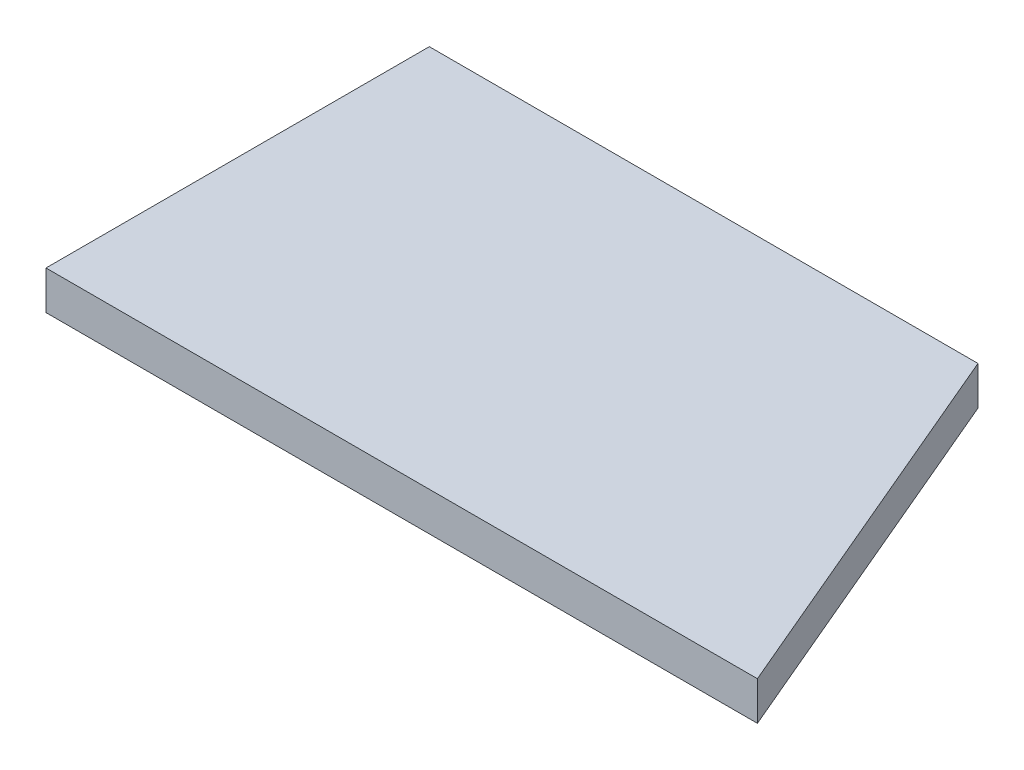
ISO-10303-21;
HEADER;
FILE_DESCRIPTION(('STEP AP214'),'2;1');
FILE_NAME('part.step','',(''),(''),'','','');
FILE_SCHEMA(('AUTOMOTIVE_DESIGN { 1 0 10303 214 1 1 1 1 }'));
ENDSEC;
DATA;
#1=APPLICATION_CONTEXT('core data for automotive mechanical design processes');
#2=APPLICATION_PROTOCOL_DEFINITION('international standard','automotive_design',2000,#1);
#3=PRODUCT_CONTEXT('',#1,'mechanical');
#4=PRODUCT('Part','Part','',(#3));
#5=PRODUCT_RELATED_PRODUCT_CATEGORY('part','',(#4));
#6=PRODUCT_DEFINITION_FORMATION('','',#4);
#7=PRODUCT_DEFINITION_CONTEXT('part definition',#1,'design');
#8=PRODUCT_DEFINITION('design','',#6,#7);
#9=PRODUCT_DEFINITION_SHAPE('','',#8);
#10=(LENGTH_UNIT() NAMED_UNIT(*) SI_UNIT(.MILLI.,.METRE.));
#11=(NAMED_UNIT(*) PLANE_ANGLE_UNIT() SI_UNIT($,.RADIAN.));
#12=(NAMED_UNIT(*) SI_UNIT($,.STERADIAN.) SOLID_ANGLE_UNIT());
#13=UNCERTAINTY_MEASURE_WITH_UNIT(LENGTH_MEASURE(1.E-05),#10,'distance_accuracy_value','');
#14=(GEOMETRIC_REPRESENTATION_CONTEXT(3) GLOBAL_UNCERTAINTY_ASSIGNED_CONTEXT((#13)) GLOBAL_UNIT_ASSIGNED_CONTEXT((#10,
#11,#12)) REPRESENTATION_CONTEXT('',''));
#15=CARTESIAN_POINT('',(0.,0.,0.));
#16=DIRECTION('',(0.,0.,1.));
#17=DIRECTION('',(1.,0.,0.));
#18=AXIS2_PLACEMENT_3D('',#15,#16,#17);
#19=CARTESIAN_POINT('',(0.,5.,-49.5707034160857));
#20=DIRECTION('',(1.,0.,0.));
#21=DIRECTION('',(0.,0.,-1.));
#22=AXIS2_PLACEMENT_3D('',#19,#20,#21);
#23=PLANE('',#22);
#24=DIRECTION('',(0.,0.,1.));
#25=VECTOR('',#24,1.);
#26=CARTESIAN_POINT('',(0.,0.,-49.5707034160857));
#27=LINE('',#26,#25);
#28=CARTESIAN_POINT('',(0.,0.,-49.5707034160857));
#29=VERTEX_POINT('',#28);
#30=CARTESIAN_POINT('',(0.,0.,0.));
#31=VERTEX_POINT('',#30);
#32=EDGE_CURVE('E97',#29,#31,#27,.T.);
#33=ORIENTED_EDGE('',*,*,#32,.T.);
#34=DIRECTION('',(0.,-1.,0.));
#35=VECTOR('',#34,1.);
#36=CARTESIAN_POINT('',(0.,5.,0.));
#37=LINE('',#36,#35);
#38=CARTESIAN_POINT('',(0.,5.,0.));
#39=VERTEX_POINT('',#38);
#40=EDGE_CURVE('E11',#39,#31,#37,.T.);
#41=ORIENTED_EDGE('',*,*,#40,.F.);
#42=DIRECTION('',(0.,0.,1.));
#43=VECTOR('',#42,1.);
#44=CARTESIAN_POINT('',(0.,5.,-49.5707034160857));
#45=LINE('',#44,#43);
#46=CARTESIAN_POINT('',(0.,5.,-49.5707034160857));
#47=VERTEX_POINT('',#46);
#48=EDGE_CURVE('E85',#47,#39,#45,.T.);
#49=ORIENTED_EDGE('',*,*,#48,.F.);
#50=DIRECTION('',(0.,-1.,0.));
#51=VECTOR('',#50,1.);
#52=CARTESIAN_POINT('',(0.,5.,-49.5707034160857));
#53=LINE('',#52,#51);
#54=EDGE_CURVE('E93',#47,#29,#53,.T.);
#55=ORIENTED_EDGE('',*,*,#54,.T.);
#56=EDGE_LOOP('',(#33,#41,#49,#55));
#57=FACE_BOUND('',#56,.T.);
#58=ADVANCED_FACE('F34',(#57),#23,.F.);
#59=CARTESIAN_POINT('',(0.,5.,0.));
#60=DIRECTION('',(0.,0.,-1.));
#61=DIRECTION('',(-1.,0.,0.));
#62=AXIS2_PLACEMENT_3D('',#59,#60,#61);
#63=PLANE('',#62);
#64=DIRECTION('',(1.,0.,0.));
#65=VECTOR('',#64,1.);
#66=CARTESIAN_POINT('',(0.,0.,0.));
#67=LINE('',#66,#65);
#68=CARTESIAN_POINT('',(92.,0.,0.));
#69=VERTEX_POINT('',#68);
#70=EDGE_CURVE('E89',#31,#69,#67,.T.);
#71=ORIENTED_EDGE('',*,*,#70,.T.);
#72=DIRECTION('',(0.,-1.,0.));
#73=VECTOR('',#72,1.);
#74=CARTESIAN_POINT('',(92.,5.,0.));
#75=LINE('',#74,#73);
#76=CARTESIAN_POINT('',(92.,5.,0.));
#77=VERTEX_POINT('',#76);
#78=EDGE_CURVE('E42',#77,#69,#75,.T.);
#79=ORIENTED_EDGE('',*,*,#78,.F.);
#80=DIRECTION('',(1.,0.,0.));
#81=VECTOR('',#80,1.);
#82=CARTESIAN_POINT('',(0.,5.,0.));
#83=LINE('',#82,#81);
#84=EDGE_CURVE('E80',#39,#77,#83,.T.);
#85=ORIENTED_EDGE('',*,*,#84,.F.);
#86=ORIENTED_EDGE('',*,*,#40,.T.);
#87=EDGE_LOOP('',(#71,#79,#85,#86));
#88=FACE_BOUND('',#87,.T.);
#89=ADVANCED_FACE('F88',(#88),#63,.F.);
#90=CARTESIAN_POINT('',(92.,5.,0.));
#91=DIRECTION('',(-0.920504853452437,0.,0.390731128489282));
#92=DIRECTION('',(0.390731128489282,0.,0.920504853452437));
#93=AXIS2_PLACEMENT_3D('',#90,#91,#92);
#94=PLANE('',#93);
#95=DIRECTION('',(-0.390731128489282,0.,-0.920504853452437));
#96=VECTOR('',#95,1.);
#97=CARTESIAN_POINT('',(92.,0.,0.));
#98=LINE('',#97,#96);
#99=CARTESIAN_POINT('',(70.9584847780756,0.,-49.5707034160857));
#100=VERTEX_POINT('',#99);
#101=EDGE_CURVE('E67',#69,#100,#98,.T.);
#102=ORIENTED_EDGE('',*,*,#101,.T.);
#103=DIRECTION('',(0.,-1.,0.));
#104=VECTOR('',#103,1.);
#105=CARTESIAN_POINT('',(70.9584847780756,5.,-49.5707034160857));
#106=LINE('',#105,#104);
#107=CARTESIAN_POINT('',(70.9584847780756,5.,-49.5707034160857));
#108=VERTEX_POINT('',#107);
#109=EDGE_CURVE('E90',#108,#100,#106,.T.);
#110=ORIENTED_EDGE('',*,*,#109,.F.);
#111=DIRECTION('',(-0.390731128489282,0.,-0.920504853452437));
#112=VECTOR('',#111,1.);
#113=CARTESIAN_POINT('',(92.,5.,0.));
#114=LINE('',#113,#112);
#115=EDGE_CURVE('E83',#77,#108,#114,.T.);
#116=ORIENTED_EDGE('',*,*,#115,.F.);
#117=ORIENTED_EDGE('',*,*,#78,.T.);
#118=EDGE_LOOP('',(#102,#110,#116,#117));
#119=FACE_BOUND('',#118,.T.);
#120=ADVANCED_FACE('F91',(#119),#94,.F.);
#121=CARTESIAN_POINT('',(70.9584847780756,5.,-49.5707034160857));
#122=DIRECTION('',(0.,0.,1.));
#123=DIRECTION('',(1.,0.,0.));
#124=AXIS2_PLACEMENT_3D('',#121,#122,#123);
#125=PLANE('',#124);
#126=DIRECTION('',(-1.,0.,0.));
#127=VECTOR('',#126,1.);
#128=CARTESIAN_POINT('',(70.9584847780756,0.,-49.5707034160857));
#129=LINE('',#128,#127);
#130=EDGE_CURVE('E73',#100,#29,#129,.T.);
#131=ORIENTED_EDGE('',*,*,#130,.T.);
#132=ORIENTED_EDGE('',*,*,#54,.F.);
#133=DIRECTION('',(-1.,0.,0.));
#134=VECTOR('',#133,1.);
#135=CARTESIAN_POINT('',(70.9584847780756,5.,-49.5707034160857));
#136=LINE('',#135,#134);
#137=EDGE_CURVE('E50',#108,#47,#136,.T.);
#138=ORIENTED_EDGE('',*,*,#137,.F.);
#139=ORIENTED_EDGE('',*,*,#109,.T.);
#140=EDGE_LOOP('',(#131,#132,#138,#139));
#141=FACE_BOUND('',#140,.T.);
#142=ADVANCED_FACE('F104',(#141),#125,.F.);
#143=CARTESIAN_POINT('',(0.,5.,0.));
#144=DIRECTION('',(0.,1.,0.));
#145=DIRECTION('',(0.,0.,1.));
#146=AXIS2_PLACEMENT_3D('',#143,#144,#145);
#147=PLANE('',#146);
#148=ORIENTED_EDGE('',*,*,#48,.T.);
#149=ORIENTED_EDGE('',*,*,#84,.T.);
#150=ORIENTED_EDGE('',*,*,#115,.T.);
#151=ORIENTED_EDGE('',*,*,#137,.T.);
#152=EDGE_LOOP('',(#148,#149,#150,#151));
#153=FACE_BOUND('',#152,.T.);
#154=ADVANCED_FACE('F81',(#153),#147,.T.);
#155=CARTESIAN_POINT('',(0.,0.,0.));
#156=DIRECTION('',(0.,1.,0.));
#157=DIRECTION('',(0.,0.,1.));
#158=AXIS2_PLACEMENT_3D('',#155,#156,#157);
#159=PLANE('',#158);
#160=ORIENTED_EDGE('',*,*,#32,.F.);
#161=ORIENTED_EDGE('',*,*,#130,.F.);
#162=ORIENTED_EDGE('',*,*,#101,.F.);
#163=ORIENTED_EDGE('',*,*,#70,.F.);
#164=EDGE_LOOP('',(#160,#161,#162,#163));
#165=FACE_BOUND('',#164,.T.);
#166=ADVANCED_FACE('F107',(#165),#159,.F.);
#167=CLOSED_SHELL('',(#58,#89,#120,#142,#154,#166));
#168=MANIFOLD_SOLID_BREP('B2',#167);
#169=ADVANCED_BREP_SHAPE_REPRESENTATION('',(#18,#168),#14);
#170=SHAPE_DEFINITION_REPRESENTATION(#9,#169);
ENDSEC;
END-ISO-10303-21;
